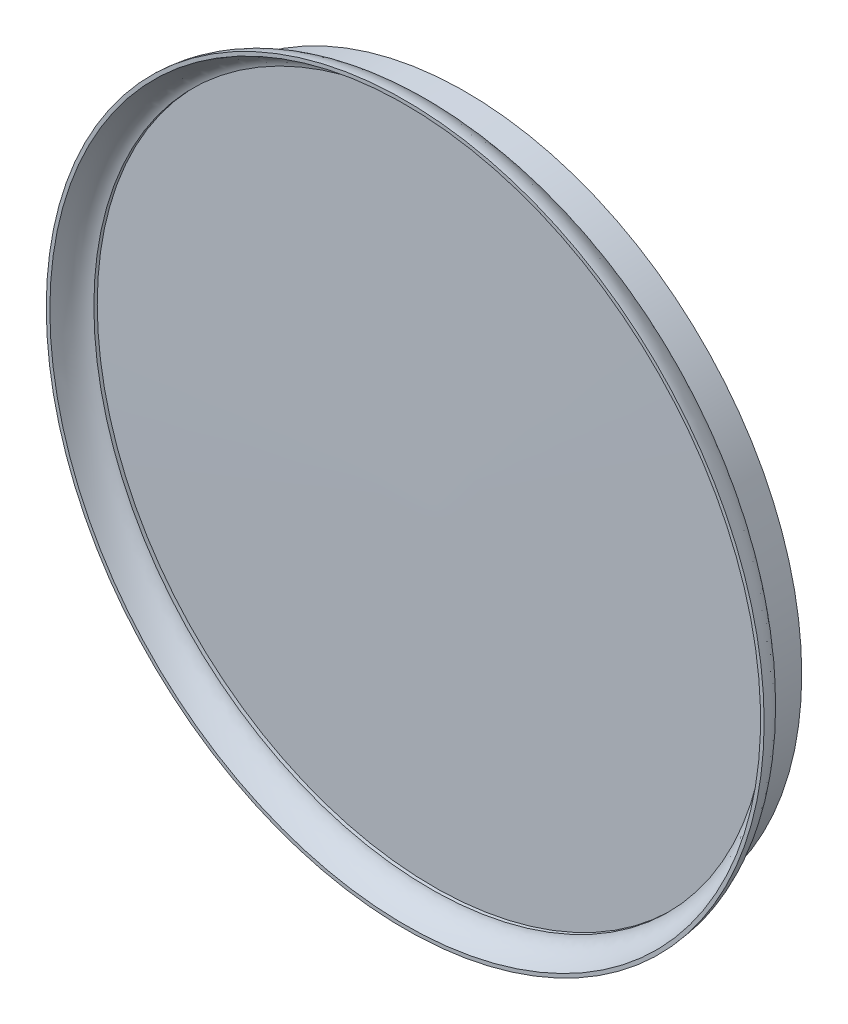
ISO-10303-21;
HEADER;
FILE_DESCRIPTION(('STEP AP214'),'2;1');
FILE_NAME('part.step','',(''),(''),'','','');
FILE_SCHEMA(('AUTOMOTIVE_DESIGN { 1 0 10303 214 1 1 1 1 }'));
ENDSEC;
DATA;
#1=APPLICATION_CONTEXT('core data for automotive mechanical design processes');
#2=APPLICATION_PROTOCOL_DEFINITION('international standard','automotive_design',2000,#1);
#3=PRODUCT_CONTEXT('',#1,'mechanical');
#4=PRODUCT('Part','Part','',(#3));
#5=PRODUCT_RELATED_PRODUCT_CATEGORY('part','',(#4));
#6=PRODUCT_DEFINITION_FORMATION('','',#4);
#7=PRODUCT_DEFINITION_CONTEXT('part definition',#1,'design');
#8=PRODUCT_DEFINITION('design','',#6,#7);
#9=PRODUCT_DEFINITION_SHAPE('','',#8);
#10=(LENGTH_UNIT() NAMED_UNIT(*) SI_UNIT(.MILLI.,.METRE.));
#11=(NAMED_UNIT(*) PLANE_ANGLE_UNIT() SI_UNIT($,.RADIAN.));
#12=(NAMED_UNIT(*) SI_UNIT($,.STERADIAN.) SOLID_ANGLE_UNIT());
#13=UNCERTAINTY_MEASURE_WITH_UNIT(LENGTH_MEASURE(1.E-05),#10,'distance_accuracy_value','');
#14=(GEOMETRIC_REPRESENTATION_CONTEXT(3) GLOBAL_UNCERTAINTY_ASSIGNED_CONTEXT((#13)) GLOBAL_UNIT_ASSIGNED_CONTEXT((#10,
#11,#12)) REPRESENTATION_CONTEXT('',''));
#15=CARTESIAN_POINT('',(0.,0.,0.));
#16=DIRECTION('',(0.,0.,1.));
#17=DIRECTION('',(1.,0.,0.));
#18=AXIS2_PLACEMENT_3D('',#15,#16,#17);
#19=CARTESIAN_POINT('',(0.,0.,4.));
#20=DIRECTION('',(0.,0.,-1.));
#21=DIRECTION('',(-1.,0.,0.));
#22=AXIS2_PLACEMENT_3D('',#19,#20,#21);
#23=CYLINDRICAL_SURFACE('',#22,44.75);
#24=CARTESIAN_POINT('',(0.,0.,4.));
#25=DIRECTION('',(0.,0.,1.));
#26=DIRECTION('',(1.,0.,0.));
#27=AXIS2_PLACEMENT_3D('',#24,#25,#26);
#28=CIRCLE('',#27,44.75);
#29=CARTESIAN_POINT('',(44.75,0.,4.));
#30=VERTEX_POINT('',#29);
#31=EDGE_CURVE('E73',#30,#30,#28,.T.);
#32=ORIENTED_EDGE('',*,*,#31,.F.);
#33=EDGE_LOOP('',(#32));
#34=FACE_BOUND('',#33,.T.);
#35=CARTESIAN_POINT('',(0.,0.,0.));
#36=DIRECTION('',(0.,0.,1.));
#37=DIRECTION('',(1.,0.,0.));
#38=AXIS2_PLACEMENT_3D('',#35,#36,#37);
#39=CIRCLE('',#38,44.75);
#40=CARTESIAN_POINT('',(44.75,0.,0.));
#41=VERTEX_POINT('',#40);
#42=EDGE_CURVE('E11',#41,#41,#39,.T.);
#43=ORIENTED_EDGE('',*,*,#42,.T.);
#44=EDGE_LOOP('',(#43));
#45=FACE_BOUND('',#44,.T.);
#46=ADVANCED_FACE('F36',(#34,#45),#23,.T.);
#47=CARTESIAN_POINT('',(0.,0.,0.));
#48=DIRECTION('',(0.,0.,1.));
#49=DIRECTION('',(1.,0.,0.));
#50=AXIS2_PLACEMENT_3D('',#47,#48,#49);
#51=PLANE('',#50);
#52=ORIENTED_EDGE('',*,*,#42,.F.);
#53=EDGE_LOOP('',(#52));
#54=FACE_BOUND('',#53,.T.);
#55=ADVANCED_FACE('F64',(#54),#51,.F.);
#56=CARTESIAN_POINT('',(0.,47.75,8.));
#57=CARTESIAN_POINT('',(0.,47.7003468196795,5.5165510601066));
#58=CARTESIAN_POINT('',(0.,44.75,4.));
#59=B_SPLINE_CURVE_WITH_KNOTS('',2,(#56,#57,#58),.UNSPECIFIED.,.F.,.F.,(3,3),(0.,
0.966897879786251),.UNSPECIFIED.);
#60=CARTESIAN_POINT('',(0.,0.,14.6180901420264));
#61=DIRECTION('',(0.,0.,1.));
#62=AXIS1_PLACEMENT('',#60,#61);
#63=SURFACE_OF_REVOLUTION('',#59,#62);
#64=ORIENTED_EDGE('',*,*,#31,.T.);
#65=EDGE_LOOP('',(#64));
#66=FACE_BOUND('',#65,.T.);
#67=CARTESIAN_POINT('',(0.,0.,8.));
#68=DIRECTION('',(0.,0.,1.));
#69=DIRECTION('',(1.,0.,0.));
#70=AXIS2_PLACEMENT_3D('',#67,#68,#69);
#71=CIRCLE('',#70,47.75);
#72=CARTESIAN_POINT('',(47.75,0.,8.));
#73=VERTEX_POINT('',#72);
#74=EDGE_CURVE('E42',#73,#73,#71,.T.);
#75=ORIENTED_EDGE('',*,*,#74,.F.);
#76=EDGE_LOOP('',(#75));
#77=FACE_BOUND('',#76,.T.);
#78=ADVANCED_FACE('F58',(#66,#77),#63,.F.);
#79=CARTESIAN_POINT('',(0.,0.,8.));
#80=DIRECTION('',(0.,0.,1.));
#81=DIRECTION('',(1.,0.,0.));
#82=AXIS2_PLACEMENT_3D('',#79,#80,#81);
#83=PLANE('',#82);
#84=CARTESIAN_POINT('',(0.,0.,8.00000000000001));
#85=DIRECTION('',(0.,0.,-1.));
#86=DIRECTION('',(-1.,0.,0.));
#87=AXIS2_PLACEMENT_3D('',#84,#85,#86);
#88=CIRCLE('',#87,47.2728514017731);
#89=CARTESIAN_POINT('',(-47.2728514017731,0.,8.00000000000001));
#90=VERTEX_POINT('',#89);
#91=EDGE_CURVE('E133',#90,#90,#88,.T.);
#92=ORIENTED_EDGE('',*,*,#91,.T.);
#93=EDGE_LOOP('',(#92));
#94=FACE_BOUND('',#93,.T.);
#95=ORIENTED_EDGE('',*,*,#74,.T.);
#96=EDGE_LOOP('',(#95));
#97=FACE_BOUND('',#96,.T.);
#98=ADVANCED_FACE('F48',(#94,#97),#83,.T.);
#99=CARTESIAN_POINT('',(0.,0.,4.44273815177156));
#100=DIRECTION('',(0.,0.,-1.));
#101=DIRECTION('',(-1.,0.,0.));
#102=AXIS2_PLACEMENT_3D('',#99,#100,#101);
#103=CONICAL_SURFACE('',#102,0.,1.56576563170434);
#104=CARTESIAN_POINT('',(0.,0.,4.21761264731543));
#105=DIRECTION('',(0.,0.,-1.));
#106=DIRECTION('',(-1.,0.,0.));
#107=AXIS2_PLACEMENT_3D('',#104,#105,#106);
#108=CIRCLE('',#107,44.75);
#109=CARTESIAN_POINT('',(-44.75,0.,4.21761264731543));
#110=VERTEX_POINT('',#109);
#111=EDGE_CURVE('E76',#110,#110,#108,.T.);
#112=ORIENTED_EDGE('',*,*,#111,.F.);
#113=EDGE_LOOP('',(#112));
#114=FACE_BOUND('',#113,.T.);
#115=CARTESIAN_POINT('',(0.,0.,4.44273815177156));
#116=VERTEX_POINT('',#115);
#117=VERTEX_LOOP('',#116);
#118=FACE_BOUND('',#117,.T.);
#119=ADVANCED_FACE('F45',(#114,#118),#103,.T.);
#120=CARTESIAN_POINT('',(0.,0.,4.44273815177156));
#121=DIRECTION('',(0.,0.,-1.));
#122=DIRECTION('',(-1.,0.,0.));
#123=AXIS2_PLACEMENT_3D('',#120,#121,#122);
#124=CYLINDRICAL_SURFACE('',#123,44.75);
#125=CARTESIAN_POINT('',(0.,0.,4.66786365622769));
#126=DIRECTION('',(0.,0.,-1.));
#127=DIRECTION('',(-1.,0.,0.));
#128=AXIS2_PLACEMENT_3D('',#125,#126,#127);
#129=CIRCLE('',#128,44.75);
#130=CARTESIAN_POINT('',(-44.75,0.,4.66786365622769));
#131=VERTEX_POINT('',#130);
#132=EDGE_CURVE('E80',#131,#131,#129,.T.);
#133=ORIENTED_EDGE('',*,*,#132,.F.);
#134=EDGE_LOOP('',(#133));
#135=FACE_BOUND('',#134,.T.);
#136=ORIENTED_EDGE('',*,*,#111,.T.);
#137=EDGE_LOOP('',(#136));
#138=FACE_BOUND('',#137,.T.);
#139=ADVANCED_FACE('F47',(#135,#138),#124,.F.);
#140=CARTESIAN_POINT('',(0.,44.75,4.66786365622769));
#141=CARTESIAN_POINT('',(0.,46.3586580096755,5.02066925728116));
#142=CARTESIAN_POINT('',(0.,47.2728514017731,8.00000000000001));
#143=B_SPLINE_CURVE_WITH_KNOTS('',2,(#140,#141,#142),.UNSPECIFIED.,.F.,.F.,(3,3),(0.,
0.527215109841536),.UNSPECIFIED.);
#144=CARTESIAN_POINT('',(0.,0.,4.44273815177156));
#145=DIRECTION('',(0.,0.,-1.));
#146=AXIS1_PLACEMENT('',#144,#145);
#147=SURFACE_OF_REVOLUTION('',#143,#146);
#148=ORIENTED_EDGE('',*,*,#91,.F.);
#149=EDGE_LOOP('',(#148));
#150=FACE_BOUND('',#149,.T.);
#151=ORIENTED_EDGE('',*,*,#132,.T.);
#152=EDGE_LOOP('',(#151));
#153=FACE_BOUND('',#152,.T.);
#154=ADVANCED_FACE('F55',(#150,#153),#147,.T.);
#155=CLOSED_SHELL('',(#46,#55,#78,#98,#119,#139,#154));
#156=MANIFOLD_SOLID_BREP('B2',#155);
#157=ADVANCED_BREP_SHAPE_REPRESENTATION('',(#18,#156),#14);
#158=SHAPE_DEFINITION_REPRESENTATION(#9,#157);
ENDSEC;
END-ISO-10303-21;
